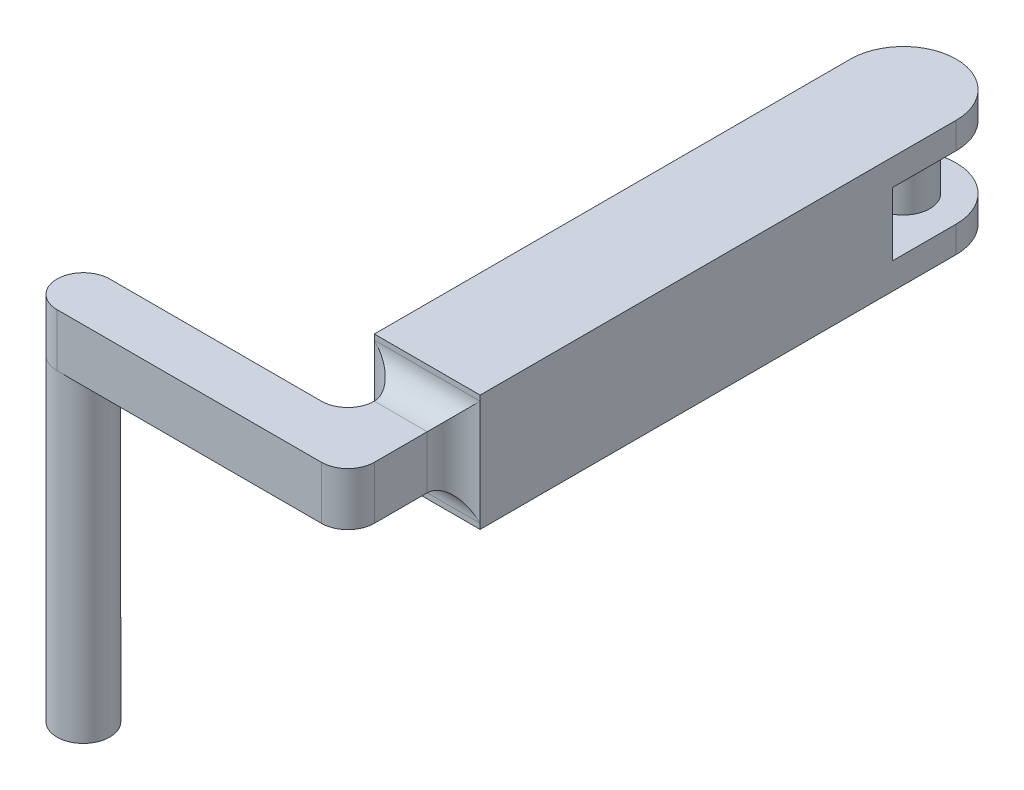
ISO-10303-21;
HEADER;
FILE_DESCRIPTION(('STEP AP214'),'2;1');
FILE_NAME('part.step','',(''),(''),'','','');
FILE_SCHEMA(('AUTOMOTIVE_DESIGN { 1 0 10303 214 1 1 1 1 }'));
ENDSEC;
DATA;
#1=APPLICATION_CONTEXT('core data for automotive mechanical design processes');
#2=APPLICATION_PROTOCOL_DEFINITION('international standard','automotive_design',2000,#1);
#3=PRODUCT_CONTEXT('',#1,'mechanical');
#4=PRODUCT('Part','Part','',(#3));
#5=PRODUCT_RELATED_PRODUCT_CATEGORY('part','',(#4));
#6=PRODUCT_DEFINITION_FORMATION('','',#4);
#7=PRODUCT_DEFINITION_CONTEXT('part definition',#1,'design');
#8=PRODUCT_DEFINITION('design','',#6,#7);
#9=PRODUCT_DEFINITION_SHAPE('','',#8);
#10=(LENGTH_UNIT() NAMED_UNIT(*) SI_UNIT(.MILLI.,.METRE.));
#11=(NAMED_UNIT(*) PLANE_ANGLE_UNIT() SI_UNIT($,.RADIAN.));
#12=(NAMED_UNIT(*) SI_UNIT($,.STERADIAN.) SOLID_ANGLE_UNIT());
#13=UNCERTAINTY_MEASURE_WITH_UNIT(LENGTH_MEASURE(1.E-05),#10,'distance_accuracy_value','');
#14=(GEOMETRIC_REPRESENTATION_CONTEXT(3) GLOBAL_UNCERTAINTY_ASSIGNED_CONTEXT((#13)) GLOBAL_UNIT_ASSIGNED_CONTEXT((#10,
#11,#12)) REPRESENTATION_CONTEXT('',''));
#15=CARTESIAN_POINT('',(0.,0.,0.));
#16=DIRECTION('',(0.,0.,1.));
#17=DIRECTION('',(1.,0.,0.));
#18=AXIS2_PLACEMENT_3D('',#15,#16,#17);
#19=CARTESIAN_POINT('',(-3.176,-0.635,-59.055));
#20=DIRECTION('',(0.,-1.,0.));
#21=DIRECTION('',(0.,0.,-1.));
#22=AXIS2_PLACEMENT_3D('',#19,#20,#21);
#23=PLANE('',#22);
#24=DIRECTION('',(0.,0.,1.));
#25=VECTOR('',#24,1.);
#26=CARTESIAN_POINT('',(25.4,-0.635,-59.055));
#27=LINE('',#26,#25);
#28=CARTESIAN_POINT('',(25.4,-0.635,-66.675));
#29=VERTEX_POINT('',#28);
#30=CARTESIAN_POINT('',(25.4,-0.635,-59.055));
#31=VERTEX_POINT('',#30);
#32=EDGE_CURVE('E348',#29,#31,#27,.T.);
#33=ORIENTED_EDGE('',*,*,#32,.T.);
#34=DIRECTION('',(1.,0.,0.));
#35=VECTOR('',#34,1.);
#36=CARTESIAN_POINT('',(-3.176,-0.635,-59.055));
#37=LINE('',#36,#35);
#38=CARTESIAN_POINT('',(38.1,-0.635,-59.055));
#39=VERTEX_POINT('',#38);
#40=EDGE_CURVE('E178',#31,#39,#37,.T.);
#41=ORIENTED_EDGE('',*,*,#40,.T.);
#42=DIRECTION('',(0.,0.,-1.));
#43=VECTOR('',#42,1.);
#44=CARTESIAN_POINT('',(38.1,-0.635,-59.055));
#45=LINE('',#44,#43);
#46=CARTESIAN_POINT('',(38.1,-0.635,-66.675));
#47=VERTEX_POINT('',#46);
#48=EDGE_CURVE('E172',#39,#47,#45,.T.);
#49=ORIENTED_EDGE('',*,*,#48,.T.);
#50=CARTESIAN_POINT('',(31.75,-0.635,-66.675));
#51=DIRECTION('',(0.,-1.,0.));
#52=DIRECTION('',(0.,0.,-1.));
#53=AXIS2_PLACEMENT_3D('',#50,#51,#52);
#54=CIRCLE('',#53,6.35);
#55=CARTESIAN_POINT('',(31.75,-0.635,-73.025));
#56=VERTEX_POINT('',#55);
#57=EDGE_CURVE('E176',#56,#47,#54,.T.);
#58=ORIENTED_EDGE('',*,*,#57,.F.);
#59=CARTESIAN_POINT('',(31.75,-0.635,-66.675));
#60=DIRECTION('',(0.,-1.,0.));
#61=DIRECTION('',(0.,0.,-1.));
#62=AXIS2_PLACEMENT_3D('',#59,#60,#61);
#63=CIRCLE('',#62,6.35);
#64=EDGE_CURVE('E193',#29,#56,#63,.T.);
#65=ORIENTED_EDGE('',*,*,#64,.F.);
#66=EDGE_LOOP('',(#33,#41,#49,#58,#65));
#67=FACE_BOUND('',#66,.T.);
#68=CARTESIAN_POINT('',(31.75,-0.635,-66.675));
#69=DIRECTION('',(0.,-1.,0.));
#70=DIRECTION('',(0.,0.,-1.));
#71=AXIS2_PLACEMENT_3D('',#68,#69,#70);
#72=CIRCLE('',#71,3.175);
#73=CARTESIAN_POINT('',(31.75,-0.635,-69.85));
#74=VERTEX_POINT('',#73);
#75=EDGE_CURVE('E11',#74,#74,#72,.F.);
#76=ORIENTED_EDGE('',*,*,#75,.F.);
#77=EDGE_LOOP('',(#76));
#78=FACE_BOUND('',#77,.T.);
#79=ADVANCED_FACE('F35',(#67,#78),#23,.F.);
#80=CARTESIAN_POINT('',(-3.176,6.985,-59.055));
#81=DIRECTION('',(0.,1.,0.));
#82=DIRECTION('',(0.,0.,1.));
#83=AXIS2_PLACEMENT_3D('',#80,#81,#82);
#84=PLANE('',#83);
#85=DIRECTION('',(0.,0.,-1.));
#86=VECTOR('',#85,1.);
#87=CARTESIAN_POINT('',(25.4,6.985,-59.055));
#88=LINE('',#87,#86);
#89=CARTESIAN_POINT('',(25.4,6.985,-59.055));
#90=VERTEX_POINT('',#89);
#91=CARTESIAN_POINT('',(25.4,6.985,-66.675));
#92=VERTEX_POINT('',#91);
#93=EDGE_CURVE('E50',#90,#92,#88,.T.);
#94=ORIENTED_EDGE('',*,*,#93,.T.);
#95=CARTESIAN_POINT('',(31.75,6.985,-66.675));
#96=DIRECTION('',(0.,1.,0.));
#97=DIRECTION('',(0.,0.,1.));
#98=AXIS2_PLACEMENT_3D('',#95,#96,#97);
#99=CIRCLE('',#98,6.35);
#100=CARTESIAN_POINT('',(31.75,6.985,-73.025));
#101=VERTEX_POINT('',#100);
#102=EDGE_CURVE('E217',#101,#92,#99,.T.);
#103=ORIENTED_EDGE('',*,*,#102,.F.);
#104=CARTESIAN_POINT('',(31.75,6.985,-66.675));
#105=DIRECTION('',(0.,1.,0.));
#106=DIRECTION('',(0.,0.,1.));
#107=AXIS2_PLACEMENT_3D('',#104,#105,#106);
#108=CIRCLE('',#107,6.35);
#109=CARTESIAN_POINT('',(38.1,6.985,-66.675));
#110=VERTEX_POINT('',#109);
#111=EDGE_CURVE('E194',#110,#101,#108,.T.);
#112=ORIENTED_EDGE('',*,*,#111,.F.);
#113=DIRECTION('',(0.,0.,1.));
#114=VECTOR('',#113,1.);
#115=CARTESIAN_POINT('',(38.1,6.985,-59.055));
#116=LINE('',#115,#114);
#117=CARTESIAN_POINT('',(38.1,6.985,-59.055));
#118=VERTEX_POINT('',#117);
#119=EDGE_CURVE('E350',#110,#118,#116,.T.);
#120=ORIENTED_EDGE('',*,*,#119,.T.);
#121=DIRECTION('',(1.,0.,0.));
#122=VECTOR('',#121,1.);
#123=CARTESIAN_POINT('',(-3.176,6.985,-59.055));
#124=LINE('',#123,#122);
#125=EDGE_CURVE('E183',#90,#118,#124,.T.);
#126=ORIENTED_EDGE('',*,*,#125,.F.);
#127=EDGE_LOOP('',(#94,#103,#112,#120,#126));
#128=FACE_BOUND('',#127,.T.);
#129=CARTESIAN_POINT('',(31.75,6.985,-66.675));
#130=DIRECTION('',(0.,1.,0.));
#131=DIRECTION('',(0.,0.,1.));
#132=AXIS2_PLACEMENT_3D('',#129,#130,#131);
#133=CIRCLE('',#132,3.175);
#134=CARTESIAN_POINT('',(31.75,6.985,-63.5));
#135=VERTEX_POINT('',#134);
#136=EDGE_CURVE('E43',#135,#135,#133,.F.);
#137=ORIENTED_EDGE('',*,*,#136,.F.);
#138=EDGE_LOOP('',(#137));
#139=FACE_BOUND('',#138,.T.);
#140=ADVANCED_FACE('F336',(#128,#139),#84,.F.);
#141=CARTESIAN_POINT('',(31.75,10.16,-66.675));
#142=DIRECTION('',(0.,-1.,0.));
#143=DIRECTION('',(0.,0.,-1.));
#144=AXIS2_PLACEMENT_3D('',#141,#142,#143);
#145=CYLINDRICAL_SURFACE('',#144,6.35);
#146=ORIENTED_EDGE('',*,*,#57,.T.);
#147=DIRECTION('',(0.,-1.,0.));
#148=VECTOR('',#147,1.);
#149=CARTESIAN_POINT('',(38.1,10.16,-66.675));
#150=LINE('',#149,#148);
#151=CARTESIAN_POINT('',(38.1,-3.81,-66.675));
#152=VERTEX_POINT('',#151);
#153=EDGE_CURVE('E191',#152,#47,#150,.F.);
#154=ORIENTED_EDGE('',*,*,#153,.F.);
#155=CARTESIAN_POINT('',(31.75,-3.81,-66.675));
#156=DIRECTION('',(0.,-1.,0.));
#157=DIRECTION('',(0.,0.,-1.));
#158=AXIS2_PLACEMENT_3D('',#155,#156,#157);
#159=CIRCLE('',#158,6.35);
#160=CARTESIAN_POINT('',(31.75,-3.81,-73.025));
#161=VERTEX_POINT('',#160);
#162=EDGE_CURVE('E322',#161,#152,#159,.T.);
#163=ORIENTED_EDGE('',*,*,#162,.F.);
#164=DIRECTION('',(0.,-1.,0.));
#165=VECTOR('',#164,1.);
#166=CARTESIAN_POINT('',(31.75,10.16,-73.025));
#167=LINE('',#166,#165);
#168=EDGE_CURVE('E192',#56,#161,#167,.T.);
#169=ORIENTED_EDGE('',*,*,#168,.F.);
#170=EDGE_LOOP('',(#146,#154,#163,#169));
#171=FACE_BOUND('',#170,.T.);
#172=ADVANCED_FACE('F189',(#171),#145,.T.);
#173=CARTESIAN_POINT('',(31.75,10.16,-66.675));
#174=DIRECTION('',(0.,-1.,0.));
#175=DIRECTION('',(0.,0.,-1.));
#176=AXIS2_PLACEMENT_3D('',#173,#174,#175);
#177=CYLINDRICAL_SURFACE('',#176,6.35);
#178=ORIENTED_EDGE('',*,*,#64,.T.);
#179=ORIENTED_EDGE('',*,*,#168,.T.);
#180=CARTESIAN_POINT('',(31.75,-3.81,-66.675));
#181=DIRECTION('',(0.,-1.,0.));
#182=DIRECTION('',(0.,0.,-1.));
#183=AXIS2_PLACEMENT_3D('',#180,#181,#182);
#184=CIRCLE('',#183,6.35);
#185=CARTESIAN_POINT('',(25.4,-3.81,-66.675));
#186=VERTEX_POINT('',#185);
#187=EDGE_CURVE('E324',#186,#161,#184,.T.);
#188=ORIENTED_EDGE('',*,*,#187,.F.);
#189=DIRECTION('',(0.,-1.,0.));
#190=VECTOR('',#189,1.);
#191=CARTESIAN_POINT('',(25.4,10.16,-66.675));
#192=LINE('',#191,#190);
#193=EDGE_CURVE('E311',#29,#186,#192,.T.);
#194=ORIENTED_EDGE('',*,*,#193,.F.);
#195=EDGE_LOOP('',(#178,#179,#188,#194));
#196=FACE_BOUND('',#195,.T.);
#197=ADVANCED_FACE('F483',(#196),#177,.T.);
#198=CARTESIAN_POINT('',(25.4,10.16,-9.525));
#199=DIRECTION('',(0.,0.,-1.));
#200=DIRECTION('',(-1.,0.,0.));
#201=AXIS2_PLACEMENT_3D('',#198,#199,#200);
#202=PLANE('',#201);
#203=DIRECTION('',(0.,-1.,0.));
#204=VECTOR('',#203,1.);
#205=CARTESIAN_POINT('',(38.1,10.16,-9.525));
#206=LINE('',#205,#204);
#207=CARTESIAN_POINT('',(38.1,-3.175,-9.525));
#208=VERTEX_POINT('',#207);
#209=CARTESIAN_POINT('',(38.1,-3.81,-9.525));
#210=VERTEX_POINT('',#209);
#211=EDGE_CURVE('E235',#208,#210,#206,.T.);
#212=ORIENTED_EDGE('',*,*,#211,.F.);
#213=DIRECTION('',(1.,0.,0.));
#214=VECTOR('',#213,1.);
#215=CARTESIAN_POINT('',(25.4,-3.175,-9.525));
#216=LINE('',#215,#214);
#217=CARTESIAN_POINT('',(25.4,-3.175,-9.525));
#218=VERTEX_POINT('',#217);
#219=EDGE_CURVE('E304',#208,#218,#216,.F.);
#220=ORIENTED_EDGE('',*,*,#219,.T.);
#221=DIRECTION('',(0.,-1.,0.));
#222=VECTOR('',#221,1.);
#223=CARTESIAN_POINT('',(25.4,10.16,-9.525));
#224=LINE('',#223,#222);
#225=CARTESIAN_POINT('',(25.4,-3.81,-9.525));
#226=VERTEX_POINT('',#225);
#227=EDGE_CURVE('E239',#218,#226,#224,.T.);
#228=ORIENTED_EDGE('',*,*,#227,.T.);
#229=DIRECTION('',(1.,0.,0.));
#230=VECTOR('',#229,1.);
#231=CARTESIAN_POINT('',(25.4,-3.81,-9.525));
#232=LINE('',#231,#230);
#233=EDGE_CURVE('E224',#226,#210,#232,.T.);
#234=ORIENTED_EDGE('',*,*,#233,.T.);
#235=EDGE_LOOP('',(#212,#220,#228,#234));
#236=FACE_BOUND('',#235,.T.);
#237=ADVANCED_FACE('F428',(#236),#202,.F.);
#238=CARTESIAN_POINT('',(0.,0.,0.));
#239=DIRECTION('',(0.,-1.,0.));
#240=DIRECTION('',(0.,0.,-1.));
#241=AXIS2_PLACEMENT_3D('',#238,#239,#240);
#242=PLANE('',#241);
#243=CARTESIAN_POINT('',(25.4,0.,-6.35));
#244=DIRECTION('',(0.,-1.,0.));
#245=DIRECTION('',(0.,0.,-1.));
#246=AXIS2_PLACEMENT_3D('',#243,#244,#245);
#247=CIRCLE('',#246,3.175);
#248=CARTESIAN_POINT('',(25.4,0.,-3.175));
#249=VERTEX_POINT('',#248);
#250=CARTESIAN_POINT('',(28.575,0.,-6.35));
#251=VERTEX_POINT('',#250);
#252=EDGE_CURVE('E295',#249,#251,#247,.F.);
#253=ORIENTED_EDGE('',*,*,#252,.T.);
#254=DIRECTION('',(1.,0.,0.));
#255=VECTOR('',#254,1.);
#256=CARTESIAN_POINT('',(0.,0.,-6.35));
#257=LINE('',#256,#255);
#258=CARTESIAN_POINT('',(34.925,0.,-6.35));
#259=VERTEX_POINT('',#258);
#260=EDGE_CURVE('E306',#251,#259,#257,.T.);
#261=ORIENTED_EDGE('',*,*,#260,.T.);
#262=DIRECTION('',(0.,0.,-1.));
#263=VECTOR('',#262,1.);
#264=CARTESIAN_POINT('',(34.925,0.,-60.325));
#265=LINE('',#264,#263);
#266=CARTESIAN_POINT('',(34.925,0.,0.));
#267=VERTEX_POINT('',#266);
#268=EDGE_CURVE('E260',#267,#259,#265,.T.);
#269=ORIENTED_EDGE('',*,*,#268,.F.);
#270=CARTESIAN_POINT('',(31.75,0.,0.));
#271=DIRECTION('',(0.,-1.,0.));
#272=DIRECTION('',(0.,0.,-1.));
#273=AXIS2_PLACEMENT_3D('',#270,#271,#272);
#274=CIRCLE('',#273,3.175);
#275=CARTESIAN_POINT('',(31.75,0.,3.175));
#276=VERTEX_POINT('',#275);
#277=EDGE_CURVE('E283',#267,#276,#274,.T.);
#278=ORIENTED_EDGE('',*,*,#277,.T.);
#279=DIRECTION('',(1.,0.,0.));
#280=VECTOR('',#279,1.);
#281=CARTESIAN_POINT('',(34.925,0.,3.17499999999999));
#282=LINE('',#281,#280);
#283=CARTESIAN_POINT('',(0.,0.,3.175));
#284=VERTEX_POINT('',#283);
#285=EDGE_CURVE('E257',#284,#276,#282,.T.);
#286=ORIENTED_EDGE('',*,*,#285,.F.);
#287=CARTESIAN_POINT('',(0.,0.,0.));
#288=DIRECTION('',(0.,1.,0.));
#289=DIRECTION('',(0.,0.,1.));
#290=AXIS2_PLACEMENT_3D('',#287,#288,#289);
#291=CIRCLE('',#290,3.175);
#292=CARTESIAN_POINT('',(0.,0.,-3.175));
#293=VERTEX_POINT('',#292);
#294=EDGE_CURVE('E268',#284,#293,#291,.T.);
#295=ORIENTED_EDGE('',*,*,#294,.T.);
#296=DIRECTION('',(-1.,0.,0.));
#297=VECTOR('',#296,1.);
#298=CARTESIAN_POINT('',(-3.175,0.,-3.175));
#299=LINE('',#298,#297);
#300=EDGE_CURVE('E250',#249,#293,#299,.T.);
#301=ORIENTED_EDGE('',*,*,#300,.F.);
#302=EDGE_LOOP('',(#253,#261,#269,#278,#286,#295,#301));
#303=FACE_BOUND('',#302,.T.);
#304=ADVANCED_FACE('F391',(#303),#242,.T.);
#305=CARTESIAN_POINT('',(34.925,6.35,-60.325));
#306=DIRECTION('',(-1.,0.,0.));
#307=DIRECTION('',(0.,0.,1.));
#308=AXIS2_PLACEMENT_3D('',#305,#306,#307);
#309=PLANE('',#308);
#310=ORIENTED_EDGE('',*,*,#268,.T.);
#311=DIRECTION('',(0.,-1.,0.));
#312=VECTOR('',#311,1.);
#313=CARTESIAN_POINT('',(34.925,6.35,-6.35));
#314=LINE('',#313,#312);
#315=CARTESIAN_POINT('',(34.925,6.35,-6.35));
#316=VERTEX_POINT('',#315);
#317=EDGE_CURVE('E308',#259,#316,#314,.F.);
#318=ORIENTED_EDGE('',*,*,#317,.T.);
#319=DIRECTION('',(0.,0.,-1.));
#320=VECTOR('',#319,1.);
#321=CARTESIAN_POINT('',(34.925,6.35,-60.325));
#322=LINE('',#321,#320);
#323=CARTESIAN_POINT('',(34.925,6.35,0.));
#324=VERTEX_POINT('',#323);
#325=EDGE_CURVE('E249',#324,#316,#322,.T.);
#326=ORIENTED_EDGE('',*,*,#325,.F.);
#327=DIRECTION('',(0.,-1.,0.));
#328=VECTOR('',#327,1.);
#329=CARTESIAN_POINT('',(34.925,6.35,0.));
#330=LINE('',#329,#328);
#331=EDGE_CURVE('E280',#324,#267,#330,.T.);
#332=ORIENTED_EDGE('',*,*,#331,.T.);
#333=EDGE_LOOP('',(#310,#318,#326,#332));
#334=FACE_BOUND('',#333,.T.);
#335=ADVANCED_FACE('F418',(#334),#309,.F.);
#336=CARTESIAN_POINT('',(0.,6.35,0.));
#337=DIRECTION('',(0.,-1.,0.));
#338=DIRECTION('',(0.,0.,-1.));
#339=AXIS2_PLACEMENT_3D('',#336,#337,#338);
#340=PLANE('',#339);
#341=ORIENTED_EDGE('',*,*,#325,.T.);
#342=DIRECTION('',(1.,0.,0.));
#343=VECTOR('',#342,1.);
#344=CARTESIAN_POINT('',(28.575,6.35,-6.35));
#345=LINE('',#344,#343);
#346=CARTESIAN_POINT('',(28.575,6.35,-6.35));
#347=VERTEX_POINT('',#346);
#348=EDGE_CURVE('E310',#316,#347,#345,.F.);
#349=ORIENTED_EDGE('',*,*,#348,.T.);
#350=CARTESIAN_POINT('',(25.4,6.35,-6.35));
#351=DIRECTION('',(0.,-1.,0.));
#352=DIRECTION('',(0.,0.,-1.));
#353=AXIS2_PLACEMENT_3D('',#350,#351,#352);
#354=CIRCLE('',#353,3.175);
#355=CARTESIAN_POINT('',(25.4,6.35,-3.175));
#356=VERTEX_POINT('',#355);
#357=EDGE_CURVE('E298',#347,#356,#354,.T.);
#358=ORIENTED_EDGE('',*,*,#357,.T.);
#359=DIRECTION('',(-1.,0.,0.));
#360=VECTOR('',#359,1.);
#361=CARTESIAN_POINT('',(-3.175,6.35,-3.175));
#362=LINE('',#361,#360);
#363=CARTESIAN_POINT('',(0.,6.35,-3.175));
#364=VERTEX_POINT('',#363);
#365=EDGE_CURVE('E253',#356,#364,#362,.T.);
#366=ORIENTED_EDGE('',*,*,#365,.T.);
#367=CARTESIAN_POINT('',(0.,6.35,0.));
#368=DIRECTION('',(0.,-1.,0.));
#369=DIRECTION('',(0.,0.,-1.));
#370=AXIS2_PLACEMENT_3D('',#367,#368,#369);
#371=CIRCLE('',#370,3.175);
#372=CARTESIAN_POINT('',(-3.175,6.35,0.));
#373=VERTEX_POINT('',#372);
#374=EDGE_CURVE('E291',#364,#373,#371,.F.);
#375=ORIENTED_EDGE('',*,*,#374,.T.);
#376=CARTESIAN_POINT('',(0.,6.35,0.));
#377=DIRECTION('',(0.,-1.,0.));
#378=DIRECTION('',(0.,0.,-1.));
#379=AXIS2_PLACEMENT_3D('',#376,#377,#378);
#380=CIRCLE('',#379,3.175);
#381=CARTESIAN_POINT('',(0.,6.35,3.175));
#382=VERTEX_POINT('',#381);
#383=EDGE_CURVE('E289',#373,#382,#380,.F.);
#384=ORIENTED_EDGE('',*,*,#383,.T.);
#385=DIRECTION('',(1.,0.,0.));
#386=VECTOR('',#385,1.);
#387=CARTESIAN_POINT('',(34.925,6.35,3.17499999999999));
#388=LINE('',#387,#386);
#389=CARTESIAN_POINT('',(31.75,6.35,3.175));
#390=VERTEX_POINT('',#389);
#391=EDGE_CURVE('E246',#382,#390,#388,.T.);
#392=ORIENTED_EDGE('',*,*,#391,.T.);
#393=CARTESIAN_POINT('',(31.75,6.35,0.));
#394=DIRECTION('',(0.,-1.,0.));
#395=DIRECTION('',(0.,0.,-1.));
#396=AXIS2_PLACEMENT_3D('',#393,#394,#395);
#397=CIRCLE('',#396,3.175);
#398=EDGE_CURVE('E293',#390,#324,#397,.F.);
#399=ORIENTED_EDGE('',*,*,#398,.T.);
#400=EDGE_LOOP('',(#341,#349,#358,#366,#375,#384,#392,#399));
#401=FACE_BOUND('',#400,.T.);
#402=ADVANCED_FACE('F374',(#401),#340,.F.);
#403=CARTESIAN_POINT('',(0.,-38.1,0.));
#404=DIRECTION('',(0.,1.,0.));
#405=DIRECTION('',(0.,0.,1.));
#406=AXIS2_PLACEMENT_3D('',#403,#404,#405);
#407=CYLINDRICAL_SURFACE('',#406,3.175);
#408=CARTESIAN_POINT('',(0.,-38.1,0.));
#409=DIRECTION('',(0.,1.,0.));
#410=DIRECTION('',(0.,0.,1.));
#411=AXIS2_PLACEMENT_3D('',#408,#409,#410);
#412=CIRCLE('',#411,3.175);
#413=CARTESIAN_POINT('',(0.,-38.1,3.175));
#414=VERTEX_POINT('',#413);
#415=EDGE_CURVE('E264',#414,#414,#412,.T.);
#416=ORIENTED_EDGE('',*,*,#415,.T.);
#417=EDGE_LOOP('',(#416));
#418=FACE_BOUND('',#417,.T.);
#419=ORIENTED_EDGE('',*,*,#294,.F.);
#420=CARTESIAN_POINT('',(-3.175,0.,0.));
#421=VERTEX_POINT('',#420);
#422=EDGE_CURVE('E256',#421,#284,#291,.T.);
#423=ORIENTED_EDGE('',*,*,#422,.F.);
#424=EDGE_CURVE('E271',#293,#421,#291,.T.);
#425=ORIENTED_EDGE('',*,*,#424,.F.);
#426=EDGE_LOOP('',(#419,#423,#425));
#427=FACE_BOUND('',#426,.T.);
#428=ADVANCED_FACE('F408',(#418,#427),#407,.T.);
#429=CARTESIAN_POINT('',(0.,-38.1,0.));
#430=DIRECTION('',(0.,1.,0.));
#431=DIRECTION('',(0.,0.,1.));
#432=AXIS2_PLACEMENT_3D('',#429,#430,#431);
#433=PLANE('',#432);
#434=ORIENTED_EDGE('',*,*,#415,.F.);
#435=EDGE_LOOP('',(#434));
#436=FACE_BOUND('',#435,.T.);
#437=ADVANCED_FACE('F461',(#436),#433,.F.);
#438=CARTESIAN_POINT('',(34.925,6.35,3.17499999999999));
#439=DIRECTION('',(0.,0.,-1.));
#440=DIRECTION('',(-1.,0.,0.));
#441=AXIS2_PLACEMENT_3D('',#438,#439,#440);
#442=PLANE('',#441);
#443=ORIENTED_EDGE('',*,*,#285,.T.);
#444=DIRECTION('',(0.,-1.,0.));
#445=VECTOR('',#444,1.);
#446=CARTESIAN_POINT('',(31.75,6.35,3.175));
#447=LINE('',#446,#445);
#448=EDGE_CURVE('E287',#276,#390,#447,.F.);
#449=ORIENTED_EDGE('',*,*,#448,.T.);
#450=ORIENTED_EDGE('',*,*,#391,.F.);
#451=DIRECTION('',(0.,-1.,0.));
#452=VECTOR('',#451,1.);
#453=CARTESIAN_POINT('',(0.,6.35,3.175));
#454=LINE('',#453,#452);
#455=EDGE_CURVE('E285',#382,#284,#454,.T.);
#456=ORIENTED_EDGE('',*,*,#455,.T.);
#457=EDGE_LOOP('',(#443,#449,#450,#456));
#458=FACE_BOUND('',#457,.T.);
#459=ADVANCED_FACE('F412',(#458),#442,.F.);
#460=CARTESIAN_POINT('',(-3.175,6.35,-3.175));
#461=DIRECTION('',(0.,0.,1.));
#462=DIRECTION('',(1.,0.,0.));
#463=AXIS2_PLACEMENT_3D('',#460,#461,#462);
#464=PLANE('',#463);
#465=ORIENTED_EDGE('',*,*,#365,.F.);
#466=DIRECTION('',(0.,-1.,0.));
#467=VECTOR('',#466,1.);
#468=CARTESIAN_POINT('',(25.4,0.,-3.175));
#469=LINE('',#468,#467);
#470=EDGE_CURVE('E274',#356,#249,#469,.T.);
#471=ORIENTED_EDGE('',*,*,#470,.T.);
#472=ORIENTED_EDGE('',*,*,#300,.T.);
#473=DIRECTION('',(0.,-1.,0.));
#474=VECTOR('',#473,1.);
#475=CARTESIAN_POINT('',(0.,6.35,-3.175));
#476=LINE('',#475,#474);
#477=EDGE_CURVE('E267',#293,#364,#476,.F.);
#478=ORIENTED_EDGE('',*,*,#477,.T.);
#479=EDGE_LOOP('',(#465,#471,#472,#478));
#480=FACE_BOUND('',#479,.T.);
#481=ADVANCED_FACE('F393',(#480),#464,.F.);
#482=CARTESIAN_POINT('',(25.4,6.35,-6.35));
#483=DIRECTION('',(0.,1.,0.));
#484=DIRECTION('',(0.,0.,1.));
#485=AXIS2_PLACEMENT_3D('',#482,#483,#484);
#486=CYLINDRICAL_SURFACE('',#485,3.175);
#487=ORIENTED_EDGE('',*,*,#357,.F.);
#488=DIRECTION('',(0.,-1.,0.));
#489=VECTOR('',#488,1.);
#490=CARTESIAN_POINT('',(28.575,6.35,-6.35));
#491=LINE('',#490,#489);
#492=EDGE_CURVE('E277',#251,#347,#491,.F.);
#493=ORIENTED_EDGE('',*,*,#492,.F.);
#494=ORIENTED_EDGE('',*,*,#252,.F.);
#495=ORIENTED_EDGE('',*,*,#470,.F.);
#496=EDGE_LOOP('',(#487,#493,#494,#495));
#497=FACE_BOUND('',#496,.T.);
#498=ADVANCED_FACE('F380',(#497),#486,.F.);
#499=CARTESIAN_POINT('',(31.75,6.35,0.));
#500=DIRECTION('',(0.,-1.,0.));
#501=DIRECTION('',(0.,0.,-1.));
#502=AXIS2_PLACEMENT_3D('',#499,#500,#501);
#503=CYLINDRICAL_SURFACE('',#502,3.175);
#504=ORIENTED_EDGE('',*,*,#398,.F.);
#505=ORIENTED_EDGE('',*,*,#448,.F.);
#506=ORIENTED_EDGE('',*,*,#277,.F.);
#507=ORIENTED_EDGE('',*,*,#331,.F.);
#508=EDGE_LOOP('',(#504,#505,#506,#507));
#509=FACE_BOUND('',#508,.T.);
#510=ADVANCED_FACE('F415',(#509),#503,.T.);
#511=CARTESIAN_POINT('',(0.,6.35,0.));
#512=DIRECTION('',(0.,-1.,0.));
#513=DIRECTION('',(0.,0.,-1.));
#514=AXIS2_PLACEMENT_3D('',#511,#512,#513);
#515=CYLINDRICAL_SURFACE('',#514,3.175);
#516=ORIENTED_EDGE('',*,*,#455,.F.);
#517=ORIENTED_EDGE('',*,*,#383,.F.);
#518=DIRECTION('',(0.,-1.,0.));
#519=VECTOR('',#518,1.);
#520=CARTESIAN_POINT('',(-3.175,6.35,0.));
#521=LINE('',#520,#519);
#522=EDGE_CURVE('E244',#421,#373,#521,.F.);
#523=ORIENTED_EDGE('',*,*,#522,.F.);
#524=ORIENTED_EDGE('',*,*,#422,.T.);
#525=EDGE_LOOP('',(#516,#517,#523,#524));
#526=FACE_BOUND('',#525,.T.);
#527=ADVANCED_FACE('F402',(#526),#515,.T.);
#528=CARTESIAN_POINT('',(0.,6.35,0.));
#529=DIRECTION('',(0.,-1.,0.));
#530=DIRECTION('',(0.,0.,-1.));
#531=AXIS2_PLACEMENT_3D('',#528,#529,#530);
#532=CYLINDRICAL_SURFACE('',#531,3.175);
#533=ORIENTED_EDGE('',*,*,#374,.F.);
#534=ORIENTED_EDGE('',*,*,#477,.F.);
#535=ORIENTED_EDGE('',*,*,#424,.T.);
#536=ORIENTED_EDGE('',*,*,#522,.T.);
#537=EDGE_LOOP('',(#533,#534,#535,#536));
#538=FACE_BOUND('',#537,.T.);
#539=ADVANCED_FACE('F405',(#538),#532,.T.);
#540=CARTESIAN_POINT('',(25.4,10.16,-9.525));
#541=DIRECTION('',(1.,0.,0.));
#542=DIRECTION('',(0.,0.,-1.));
#543=AXIS2_PLACEMENT_3D('',#540,#541,#542);
#544=PLANE('',#543);
#545=DIRECTION('',(0.,1.,0.));
#546=VECTOR('',#545,1.);
#547=CARTESIAN_POINT('',(25.4,-0.635,-59.055));
#548=LINE('',#547,#546);
#549=EDGE_CURVE('E345',#31,#90,#548,.T.);
#550=ORIENTED_EDGE('',*,*,#549,.F.);
#551=ORIENTED_EDGE('',*,*,#32,.F.);
#552=ORIENTED_EDGE('',*,*,#193,.T.);
#553=DIRECTION('',(0.,0.,1.));
#554=VECTOR('',#553,1.);
#555=CARTESIAN_POINT('',(25.4,-3.81,-9.525));
#556=LINE('',#555,#554);
#557=EDGE_CURVE('E222',#186,#226,#556,.T.);
#558=ORIENTED_EDGE('',*,*,#557,.T.);
#559=ORIENTED_EDGE('',*,*,#227,.F.);
#560=CARTESIAN_POINT('',(25.4,9.525,-9.525));
#561=VERTEX_POINT('',#560);
#562=EDGE_CURVE('E245',#561,#218,#224,.T.);
#563=ORIENTED_EDGE('',*,*,#562,.F.);
#564=CARTESIAN_POINT('',(25.4,10.16,-9.525));
#565=VERTEX_POINT('',#564);
#566=EDGE_CURVE('E241',#565,#561,#224,.T.);
#567=ORIENTED_EDGE('',*,*,#566,.F.);
#568=DIRECTION('',(0.,0.,1.));
#569=VECTOR('',#568,1.);
#570=CARTESIAN_POINT('',(25.4,10.16,-9.525));
#571=LINE('',#570,#569);
#572=CARTESIAN_POINT('',(25.4,10.16,-66.675));
#573=VERTEX_POINT('',#572);
#574=EDGE_CURVE('E229',#573,#565,#571,.T.);
#575=ORIENTED_EDGE('',*,*,#574,.F.);
#576=EDGE_CURVE('E319',#573,#92,#192,.T.);
#577=ORIENTED_EDGE('',*,*,#576,.T.);
#578=ORIENTED_EDGE('',*,*,#93,.F.);
#579=EDGE_LOOP('',(#550,#551,#552,#558,#559,#563,#567,#575,#577,#578));
#580=FACE_BOUND('',#579,.T.);
#581=ADVANCED_FACE('F332',(#580),#544,.F.);
#582=ORIENTED_EDGE('',*,*,#566,.T.);
#583=DIRECTION('',(1.,0.,0.));
#584=VECTOR('',#583,1.);
#585=CARTESIAN_POINT('',(34.925,9.525,-9.525));
#586=LINE('',#585,#584);
#587=CARTESIAN_POINT('',(38.1,9.525,-9.525));
#588=VERTEX_POINT('',#587);
#589=EDGE_CURVE('E300',#561,#588,#586,.T.);
#590=ORIENTED_EDGE('',*,*,#589,.T.);
#591=CARTESIAN_POINT('',(38.1,10.16,-9.525));
#592=VERTEX_POINT('',#591);
#593=EDGE_CURVE('E236',#592,#588,#206,.T.);
#594=ORIENTED_EDGE('',*,*,#593,.F.);
#595=DIRECTION('',(1.,0.,0.));
#596=VECTOR('',#595,1.);
#597=CARTESIAN_POINT('',(25.4,10.16,-9.525));
#598=LINE('',#597,#596);
#599=EDGE_CURVE('E231',#565,#592,#598,.T.);
#600=ORIENTED_EDGE('',*,*,#599,.F.);
#601=EDGE_LOOP('',(#582,#590,#594,#600));
#602=FACE_BOUND('',#601,.T.);
#603=ADVANCED_FACE('F358',(#602),#202,.F.);
#604=CARTESIAN_POINT('',(38.1,10.16,-9.525));
#605=DIRECTION('',(-1.,0.,0.));
#606=DIRECTION('',(0.,0.,1.));
#607=AXIS2_PLACEMENT_3D('',#604,#605,#606);
#608=PLANE('',#607);
#609=ORIENTED_EDGE('',*,*,#153,.T.);
#610=ORIENTED_EDGE('',*,*,#48,.F.);
#611=DIRECTION('',(0.,-1.,0.));
#612=VECTOR('',#611,1.);
#613=CARTESIAN_POINT('',(38.1,-0.635,-59.055));
#614=LINE('',#613,#612);
#615=EDGE_CURVE('E184',#118,#39,#614,.T.);
#616=ORIENTED_EDGE('',*,*,#615,.F.);
#617=ORIENTED_EDGE('',*,*,#119,.F.);
#618=CARTESIAN_POINT('',(38.1,10.16,-66.675));
#619=VERTEX_POINT('',#618);
#620=EDGE_CURVE('E200',#110,#619,#150,.F.);
#621=ORIENTED_EDGE('',*,*,#620,.T.);
#622=DIRECTION('',(0.,0.,-1.));
#623=VECTOR('',#622,1.);
#624=CARTESIAN_POINT('',(38.1,10.16,-9.525));
#625=LINE('',#624,#623);
#626=EDGE_CURVE('E233',#592,#619,#625,.T.);
#627=ORIENTED_EDGE('',*,*,#626,.F.);
#628=ORIENTED_EDGE('',*,*,#593,.T.);
#629=EDGE_CURVE('E240',#588,#208,#206,.T.);
#630=ORIENTED_EDGE('',*,*,#629,.T.);
#631=ORIENTED_EDGE('',*,*,#211,.T.);
#632=DIRECTION('',(0.,0.,-1.));
#633=VECTOR('',#632,1.);
#634=CARTESIAN_POINT('',(38.1,-3.81,-9.525));
#635=LINE('',#634,#633);
#636=EDGE_CURVE('E199',#210,#152,#635,.T.);
#637=ORIENTED_EDGE('',*,*,#636,.T.);
#638=EDGE_LOOP('',(#609,#610,#616,#617,#621,#627,#628,#630,#631,#637));
#639=FACE_BOUND('',#638,.T.);
#640=ADVANCED_FACE('F197',(#639),#608,.F.);
#641=CARTESIAN_POINT('',(0.,10.16,0.));
#642=DIRECTION('',(0.,-1.,0.));
#643=DIRECTION('',(0.,0.,-1.));
#644=AXIS2_PLACEMENT_3D('',#641,#642,#643);
#645=PLANE('',#644);
#646=CARTESIAN_POINT('',(31.75,10.16,-66.675));
#647=DIRECTION('',(0.,-1.,0.));
#648=DIRECTION('',(0.,0.,-1.));
#649=AXIS2_PLACEMENT_3D('',#646,#647,#648);
#650=CIRCLE('',#649,6.35);
#651=CARTESIAN_POINT('',(31.75,10.16,-73.025));
#652=VERTEX_POINT('',#651);
#653=EDGE_CURVE('E58',#619,#652,#650,.F.);
#654=ORIENTED_EDGE('',*,*,#653,.T.);
#655=CARTESIAN_POINT('',(31.75,10.16,-66.675));
#656=DIRECTION('',(0.,-1.,0.));
#657=DIRECTION('',(0.,0.,-1.));
#658=AXIS2_PLACEMENT_3D('',#655,#656,#657);
#659=CIRCLE('',#658,6.35);
#660=EDGE_CURVE('E203',#652,#573,#659,.F.);
#661=ORIENTED_EDGE('',*,*,#660,.T.);
#662=ORIENTED_EDGE('',*,*,#574,.T.);
#663=ORIENTED_EDGE('',*,*,#599,.T.);
#664=ORIENTED_EDGE('',*,*,#626,.T.);
#665=EDGE_LOOP('',(#654,#661,#662,#663,#664));
#666=FACE_BOUND('',#665,.T.);
#667=ADVANCED_FACE('F326',(#666),#645,.F.);
#668=CARTESIAN_POINT('',(0.,-3.81,0.));
#669=DIRECTION('',(0.,-1.,0.));
#670=DIRECTION('',(0.,0.,-1.));
#671=AXIS2_PLACEMENT_3D('',#668,#669,#670);
#672=PLANE('',#671);
#673=ORIENTED_EDGE('',*,*,#557,.F.);
#674=ORIENTED_EDGE('',*,*,#187,.T.);
#675=ORIENTED_EDGE('',*,*,#162,.T.);
#676=ORIENTED_EDGE('',*,*,#636,.F.);
#677=ORIENTED_EDGE('',*,*,#233,.F.);
#678=EDGE_LOOP('',(#673,#674,#675,#676,#677));
#679=FACE_BOUND('',#678,.T.);
#680=ADVANCED_FACE('F444',(#679),#672,.T.);
#681=CARTESIAN_POINT('',(38.1,10.16,-6.35));
#682=DIRECTION('',(0.,1.,0.));
#683=DIRECTION('',(0.,0.,1.));
#684=AXIS2_PLACEMENT_3D('',#681,#682,#683);
#685=CYLINDRICAL_SURFACE('',#684,3.175);
#686=CARTESIAN_POINT('',(38.1,9.525,-6.35));
#687=DIRECTION('',(-0.707106781186547,0.707106781186547,0.));
#688=DIRECTION('',(-0.707106781186547,-0.707106781186547,0.));
#689=AXIS2_PLACEMENT_3D('',#686,#687,#688);
#690=ELLIPSE('',#689,4.49012806053458,3.175);
#691=EDGE_CURVE('E314',#316,#588,#690,.F.);
#692=ORIENTED_EDGE('',*,*,#691,.F.);
#693=ORIENTED_EDGE('',*,*,#317,.F.);
#694=CARTESIAN_POINT('',(38.1,-3.175,-6.35));
#695=DIRECTION('',(0.707106781186547,0.707106781186547,0.));
#696=DIRECTION('',(-0.707106781186547,0.707106781186547,0.));
#697=AXIS2_PLACEMENT_3D('',#694,#695,#696);
#698=ELLIPSE('',#697,4.49012806053458,3.175);
#699=EDGE_CURVE('E225',#208,#259,#698,.T.);
#700=ORIENTED_EDGE('',*,*,#699,.F.);
#701=ORIENTED_EDGE('',*,*,#629,.F.);
#702=EDGE_LOOP('',(#692,#693,#700,#701));
#703=FACE_BOUND('',#702,.T.);
#704=ADVANCED_FACE('F365',(#703),#685,.F.);
#705=CARTESIAN_POINT('',(0.,-3.175,-6.35));
#706=DIRECTION('',(1.,0.,0.));
#707=DIRECTION('',(0.,0.,-1.));
#708=AXIS2_PLACEMENT_3D('',#705,#706,#707);
#709=CYLINDRICAL_SURFACE('',#708,3.175);
#710=ORIENTED_EDGE('',*,*,#699,.T.);
#711=ORIENTED_EDGE('',*,*,#260,.F.);
#712=CARTESIAN_POINT('',(25.4,-3.175,-6.35));
#713=DIRECTION('',(0.707106781186547,-0.707106781186547,0.));
#714=DIRECTION('',(0.707106781186547,0.707106781186547,0.));
#715=AXIS2_PLACEMENT_3D('',#712,#713,#714);
#716=ELLIPSE('',#715,4.49012806053458,3.175);
#717=EDGE_CURVE('E212',#218,#251,#716,.T.);
#718=ORIENTED_EDGE('',*,*,#717,.F.);
#719=ORIENTED_EDGE('',*,*,#219,.F.);
#720=EDGE_LOOP('',(#710,#711,#718,#719));
#721=FACE_BOUND('',#720,.T.);
#722=ADVANCED_FACE('F387',(#721),#709,.F.);
#723=CARTESIAN_POINT('',(25.4,9.525,-6.35));
#724=DIRECTION('',(-1.,0.,0.));
#725=DIRECTION('',(0.,0.,1.));
#726=AXIS2_PLACEMENT_3D('',#723,#724,#725);
#727=CYLINDRICAL_SURFACE('',#726,3.175);
#728=ORIENTED_EDGE('',*,*,#691,.T.);
#729=ORIENTED_EDGE('',*,*,#589,.F.);
#730=CARTESIAN_POINT('',(25.4,9.525,-6.35));
#731=DIRECTION('',(-0.707106781186547,-0.707106781186547,0.));
#732=DIRECTION('',(-0.707106781186547,0.707106781186547,0.));
#733=AXIS2_PLACEMENT_3D('',#730,#731,#732);
#734=ELLIPSE('',#733,4.49012806053458,3.175);
#735=EDGE_CURVE('E209',#347,#561,#734,.F.);
#736=ORIENTED_EDGE('',*,*,#735,.F.);
#737=ORIENTED_EDGE('',*,*,#348,.F.);
#738=EDGE_LOOP('',(#728,#729,#736,#737));
#739=FACE_BOUND('',#738,.T.);
#740=ADVANCED_FACE('F370',(#739),#727,.F.);
#741=CARTESIAN_POINT('',(25.4,10.16,-6.35));
#742=DIRECTION('',(0.,-1.,0.));
#743=DIRECTION('',(0.,0.,-1.));
#744=AXIS2_PLACEMENT_3D('',#741,#742,#743);
#745=CYLINDRICAL_SURFACE('',#744,3.175);
#746=ORIENTED_EDGE('',*,*,#717,.T.);
#747=ORIENTED_EDGE('',*,*,#492,.T.);
#748=ORIENTED_EDGE('',*,*,#735,.T.);
#749=ORIENTED_EDGE('',*,*,#562,.T.);
#750=EDGE_LOOP('',(#746,#747,#748,#749));
#751=FACE_BOUND('',#750,.T.);
#752=ADVANCED_FACE('F382',(#751),#745,.F.);
#753=ORIENTED_EDGE('',*,*,#111,.T.);
#754=EDGE_CURVE('E207',#652,#101,#167,.T.);
#755=ORIENTED_EDGE('',*,*,#754,.F.);
#756=ORIENTED_EDGE('',*,*,#653,.F.);
#757=ORIENTED_EDGE('',*,*,#620,.F.);
#758=EDGE_LOOP('',(#753,#755,#756,#757));
#759=FACE_BOUND('',#758,.T.);
#760=ADVANCED_FACE('F37',(#759),#145,.T.);
#761=ORIENTED_EDGE('',*,*,#102,.T.);
#762=ORIENTED_EDGE('',*,*,#576,.F.);
#763=ORIENTED_EDGE('',*,*,#660,.F.);
#764=ORIENTED_EDGE('',*,*,#754,.T.);
#765=EDGE_LOOP('',(#761,#762,#763,#764));
#766=FACE_BOUND('',#765,.T.);
#767=ADVANCED_FACE('F334',(#766),#177,.T.);
#768=CARTESIAN_POINT('',(-3.176,-0.635,-59.055));
#769=DIRECTION('',(0.,0.,1.));
#770=DIRECTION('',(1.,0.,0.));
#771=AXIS2_PLACEMENT_3D('',#768,#769,#770);
#772=PLANE('',#771);
#773=ORIENTED_EDGE('',*,*,#549,.T.);
#774=ORIENTED_EDGE('',*,*,#125,.T.);
#775=ORIENTED_EDGE('',*,*,#615,.T.);
#776=ORIENTED_EDGE('',*,*,#40,.F.);
#777=EDGE_LOOP('',(#773,#774,#775,#776));
#778=FACE_BOUND('',#777,.T.);
#779=ADVANCED_FACE('F354',(#778),#772,.F.);
#780=CARTESIAN_POINT('',(31.75,9.525,-66.675));
#781=DIRECTION('',(0.,-1.,0.));
#782=DIRECTION('',(0.,0.,-1.));
#783=AXIS2_PLACEMENT_3D('',#780,#781,#782);
#784=CYLINDRICAL_SURFACE('',#783,3.175);
#785=ORIENTED_EDGE('',*,*,#75,.T.);
#786=EDGE_LOOP('',(#785));
#787=FACE_BOUND('',#786,.T.);
#788=ORIENTED_EDGE('',*,*,#136,.T.);
#789=EDGE_LOOP('',(#788));
#790=FACE_BOUND('',#789,.T.);
#791=ADVANCED_FACE('F441',(#787,#790),#784,.T.);
#792=CLOSED_SHELL('',(#79,#140,#172,#197,#237,#304,#335,#402,#428,#437,#459,#481,#498,#510,#527,
#539,#581,#603,#640,#667,#680,#704,#722,#740,#752,#760,#767,#779,#791));
#793=MANIFOLD_SOLID_BREP('B2',#792);
#794=ADVANCED_BREP_SHAPE_REPRESENTATION('',(#18,#793),#14);
#795=SHAPE_DEFINITION_REPRESENTATION(#9,#794);
ENDSEC;
END-ISO-10303-21;
